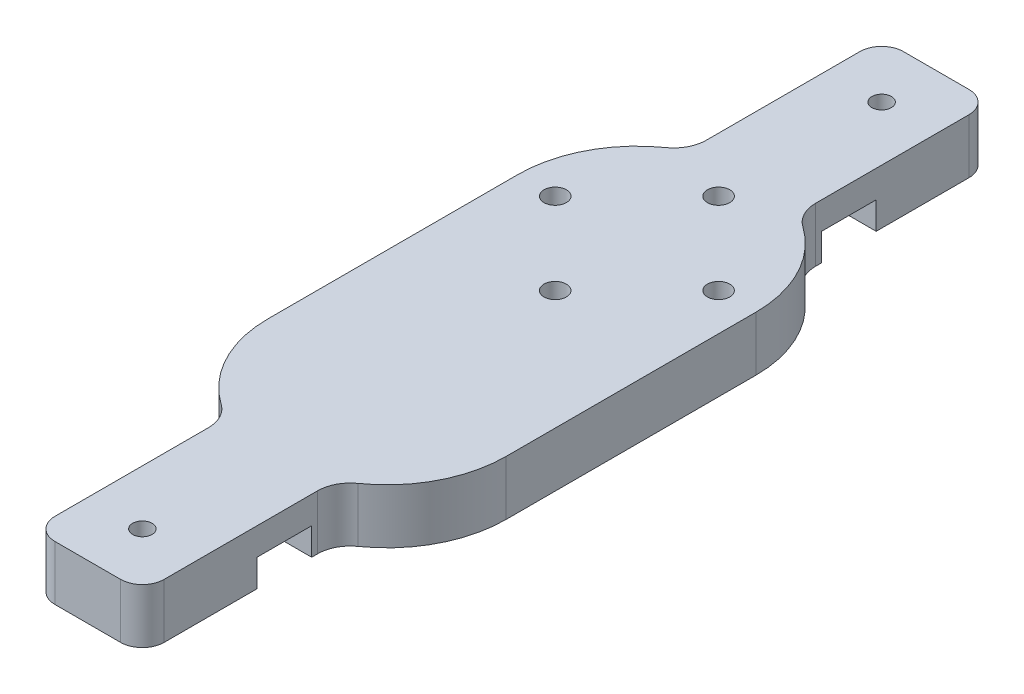
ISO-10303-21;
HEADER;
FILE_DESCRIPTION(('STEP AP214'),'2;1');
FILE_NAME('part.step','',(''),(''),'','','');
FILE_SCHEMA(('AUTOMOTIVE_DESIGN { 1 0 10303 214 1 1 1 1 }'));
ENDSEC;
DATA;
#1=APPLICATION_CONTEXT('core data for automotive mechanical design processes');
#2=APPLICATION_PROTOCOL_DEFINITION('international standard','automotive_design',2000,#1);
#3=PRODUCT_CONTEXT('',#1,'mechanical');
#4=PRODUCT('Part','Part','',(#3));
#5=PRODUCT_RELATED_PRODUCT_CATEGORY('part','',(#4));
#6=PRODUCT_DEFINITION_FORMATION('','',#4);
#7=PRODUCT_DEFINITION_CONTEXT('part definition',#1,'design');
#8=PRODUCT_DEFINITION('design','',#6,#7);
#9=PRODUCT_DEFINITION_SHAPE('','',#8);
#10=(LENGTH_UNIT() NAMED_UNIT(*) SI_UNIT(.MILLI.,.METRE.));
#11=(NAMED_UNIT(*) PLANE_ANGLE_UNIT() SI_UNIT($,.RADIAN.));
#12=(NAMED_UNIT(*) SI_UNIT($,.STERADIAN.) SOLID_ANGLE_UNIT());
#13=UNCERTAINTY_MEASURE_WITH_UNIT(LENGTH_MEASURE(1.E-05),#10,'distance_accuracy_value','');
#14=(GEOMETRIC_REPRESENTATION_CONTEXT(3) GLOBAL_UNCERTAINTY_ASSIGNED_CONTEXT((#13)) GLOBAL_UNIT_ASSIGNED_CONTEXT((#10,
#11,#12)) REPRESENTATION_CONTEXT('',''));
#15=CARTESIAN_POINT('',(0.,0.,0.));
#16=DIRECTION('',(0.,0.,1.));
#17=DIRECTION('',(1.,0.,0.));
#18=AXIS2_PLACEMENT_3D('',#15,#16,#17);
#19=CARTESIAN_POINT('',(6.35,6.35,36.062769886));
#20=DIRECTION('',(-1.,0.,0.));
#21=DIRECTION('',(0.,0.,1.));
#22=AXIS2_PLACEMENT_3D('',#19,#20,#21);
#23=PLANE('',#22);
#24=DIRECTION('',(0.,0.,-1.));
#25=VECTOR('',#24,1.);
#26=CARTESIAN_POINT('',(6.35,0.,36.062769886));
#27=LINE('',#26,#25);
#28=CARTESIAN_POINT('',(6.35,0.,38.878651732));
#29=VERTEX_POINT('',#28);
#30=CARTESIAN_POINT('',(6.35,0.,38.19895848807));
#31=VERTEX_POINT('',#30);
#32=EDGE_CURVE('E330',#29,#31,#27,.T.);
#33=ORIENTED_EDGE('',*,*,#32,.T.);
#34=DIRECTION('',(0.,1.,0.));
#35=VECTOR('',#34,1.);
#36=CARTESIAN_POINT('',(6.35,6.35,38.19895848807));
#37=LINE('',#36,#35);
#38=CARTESIAN_POINT('',(6.35,6.35,38.19895848807));
#39=VERTEX_POINT('',#38);
#40=EDGE_CURVE('E413',#31,#39,#37,.T.);
#41=ORIENTED_EDGE('',*,*,#40,.T.);
#42=DIRECTION('',(0.,0.,-1.));
#43=VECTOR('',#42,1.);
#44=CARTESIAN_POINT('',(6.35,6.35,36.062769886));
#45=LINE('',#44,#43);
#46=CARTESIAN_POINT('',(6.35,6.35,56.023651732));
#47=VERTEX_POINT('',#46);
#48=EDGE_CURVE('E293',#47,#39,#45,.T.);
#49=ORIENTED_EDGE('',*,*,#48,.F.);
#50=DIRECTION('',(0.,-1.,0.));
#51=VECTOR('',#50,1.);
#52=CARTESIAN_POINT('',(6.35,6.35,56.023651732));
#53=LINE('',#52,#51);
#54=CARTESIAN_POINT('',(6.35,0.,56.023651732));
#55=VERTEX_POINT('',#54);
#56=EDGE_CURVE('E397',#47,#55,#53,.T.);
#57=ORIENTED_EDGE('',*,*,#56,.T.);
#58=CARTESIAN_POINT('',(6.35,0.,45.228651732));
#59=VERTEX_POINT('',#58);
#60=EDGE_CURVE('E331',#55,#59,#27,.T.);
#61=ORIENTED_EDGE('',*,*,#60,.T.);
#62=DIRECTION('',(0.,-1.,0.));
#63=VECTOR('',#62,1.);
#64=CARTESIAN_POINT('',(6.35,3.175,45.228651732));
#65=LINE('',#64,#63);
#66=CARTESIAN_POINT('',(6.35,3.175,45.228651732));
#67=VERTEX_POINT('',#66);
#68=EDGE_CURVE('E254',#67,#59,#65,.T.);
#69=ORIENTED_EDGE('',*,*,#68,.F.);
#70=DIRECTION('',(0.,0.,1.));
#71=VECTOR('',#70,1.);
#72=CARTESIAN_POINT('',(6.35,3.175,0.));
#73=LINE('',#72,#71);
#74=CARTESIAN_POINT('',(6.35,3.175,38.878651732));
#75=VERTEX_POINT('',#74);
#76=EDGE_CURVE('E272',#75,#67,#73,.T.);
#77=ORIENTED_EDGE('',*,*,#76,.F.);
#78=DIRECTION('',(0.,-1.,0.));
#79=VECTOR('',#78,1.);
#80=CARTESIAN_POINT('',(6.35,3.175,38.878651732));
#81=LINE('',#80,#79);
#82=EDGE_CURVE('E282',#75,#29,#81,.T.);
#83=ORIENTED_EDGE('',*,*,#82,.T.);
#84=EDGE_LOOP('',(#33,#41,#49,#57,#61,#69,#77,#83));
#85=FACE_BOUND('',#84,.T.);
#86=ADVANCED_FACE('F36',(#85),#23,.F.);
#87=CARTESIAN_POINT('',(6.35,6.35,-17.6002686339026));
#88=DIRECTION('',(-1.,0.,0.));
#89=DIRECTION('',(0.,0.,1.));
#90=AXIS2_PLACEMENT_3D('',#87,#88,#89);
#91=PLANE('',#90);
#92=DIRECTION('',(0.,0.,-1.));
#93=VECTOR('',#92,1.);
#94=CARTESIAN_POINT('',(6.35,6.35,-17.6002686339026));
#95=LINE('',#94,#93);
#96=CARTESIAN_POINT('',(6.35,6.35,-19.7364572359725));
#97=VERTEX_POINT('',#96);
#98=CARTESIAN_POINT('',(6.35,6.35,-37.56114916));
#99=VERTEX_POINT('',#98);
#100=EDGE_CURVE('E303',#97,#99,#95,.T.);
#101=ORIENTED_EDGE('',*,*,#100,.F.);
#102=DIRECTION('',(0.,1.,0.));
#103=VECTOR('',#102,1.);
#104=CARTESIAN_POINT('',(6.35,0.,-19.7364572359725));
#105=LINE('',#104,#103);
#106=CARTESIAN_POINT('',(6.35,0.,-19.7364572359725));
#107=VERTEX_POINT('',#106);
#108=EDGE_CURVE('E415',#97,#107,#105,.F.);
#109=ORIENTED_EDGE('',*,*,#108,.T.);
#110=DIRECTION('',(0.,0.,-1.));
#111=VECTOR('',#110,1.);
#112=CARTESIAN_POINT('',(6.35,0.,-17.6002686339026));
#113=LINE('',#112,#111);
#114=CARTESIAN_POINT('',(6.35,0.,-20.41614916));
#115=VERTEX_POINT('',#114);
#116=EDGE_CURVE('E341',#107,#115,#113,.T.);
#117=ORIENTED_EDGE('',*,*,#116,.T.);
#118=DIRECTION('',(0.,-1.,0.));
#119=VECTOR('',#118,1.);
#120=CARTESIAN_POINT('',(6.35,3.175,-20.41614916));
#121=LINE('',#120,#119);
#122=CARTESIAN_POINT('',(6.35,3.175,-20.41614916));
#123=VERTEX_POINT('',#122);
#124=EDGE_CURVE('E256',#123,#115,#121,.T.);
#125=ORIENTED_EDGE('',*,*,#124,.F.);
#126=DIRECTION('',(0.,0.,1.));
#127=VECTOR('',#126,1.);
#128=CARTESIAN_POINT('',(6.35,3.175,0.));
#129=LINE('',#128,#127);
#130=CARTESIAN_POINT('',(6.35,3.175,-26.76614916));
#131=VERTEX_POINT('',#130);
#132=EDGE_CURVE('E233',#131,#123,#129,.T.);
#133=ORIENTED_EDGE('',*,*,#132,.F.);
#134=DIRECTION('',(0.,-1.,0.));
#135=VECTOR('',#134,1.);
#136=CARTESIAN_POINT('',(6.35,3.175,-26.76614916));
#137=LINE('',#136,#135);
#138=CARTESIAN_POINT('',(6.35,0.,-26.76614916));
#139=VERTEX_POINT('',#138);
#140=EDGE_CURVE('E259',#131,#139,#137,.T.);
#141=ORIENTED_EDGE('',*,*,#140,.T.);
#142=CARTESIAN_POINT('',(6.35,0.,-37.56114916));
#143=VERTEX_POINT('',#142);
#144=EDGE_CURVE('E340',#139,#143,#113,.T.);
#145=ORIENTED_EDGE('',*,*,#144,.T.);
#146=DIRECTION('',(0.,-1.,0.));
#147=VECTOR('',#146,1.);
#148=CARTESIAN_POINT('',(6.35,6.35,-37.56114916));
#149=LINE('',#148,#147);
#150=EDGE_CURVE('E388',#99,#143,#149,.T.);
#151=ORIENTED_EDGE('',*,*,#150,.F.);
#152=EDGE_LOOP('',(#101,#109,#117,#125,#133,#141,#145,#151));
#153=FACE_BOUND('',#152,.T.);
#154=ADVANCED_FACE('F506',(#153),#91,.F.);
#155=CARTESIAN_POINT('',(-6.35,6.35,-17.6002686339026));
#156=DIRECTION('',(1.,0.,0.));
#157=DIRECTION('',(0.,0.,-1.));
#158=AXIS2_PLACEMENT_3D('',#155,#156,#157);
#159=PLANE('',#158);
#160=DIRECTION('',(0.,0.,1.));
#161=VECTOR('',#160,1.);
#162=CARTESIAN_POINT('',(-6.35,0.,-17.6002686339026));
#163=LINE('',#162,#161);
#164=CARTESIAN_POINT('',(-6.35,0.,-20.41614916));
#165=VERTEX_POINT('',#164);
#166=CARTESIAN_POINT('',(-6.35,0.,-19.7364572359725));
#167=VERTEX_POINT('',#166);
#168=EDGE_CURVE('E349',#165,#167,#163,.T.);
#169=ORIENTED_EDGE('',*,*,#168,.T.);
#170=DIRECTION('',(0.,1.,0.));
#171=VECTOR('',#170,1.);
#172=CARTESIAN_POINT('',(-6.35,6.35,-19.7364572359725));
#173=LINE('',#172,#171);
#174=CARTESIAN_POINT('',(-6.35,6.35,-19.7364572359725));
#175=VERTEX_POINT('',#174);
#176=EDGE_CURVE('E408',#167,#175,#173,.T.);
#177=ORIENTED_EDGE('',*,*,#176,.T.);
#178=DIRECTION('',(0.,0.,1.));
#179=VECTOR('',#178,1.);
#180=CARTESIAN_POINT('',(-6.35,6.35,-17.6002686339026));
#181=LINE('',#180,#179);
#182=CARTESIAN_POINT('',(-6.35,6.35,-37.56114916));
#183=VERTEX_POINT('',#182);
#184=EDGE_CURVE('E311',#183,#175,#181,.T.);
#185=ORIENTED_EDGE('',*,*,#184,.F.);
#186=DIRECTION('',(0.,-1.,0.));
#187=VECTOR('',#186,1.);
#188=CARTESIAN_POINT('',(-6.35,6.35,-37.56114916));
#189=LINE('',#188,#187);
#190=CARTESIAN_POINT('',(-6.35,0.,-37.56114916));
#191=VERTEX_POINT('',#190);
#192=EDGE_CURVE('E379',#183,#191,#189,.T.);
#193=ORIENTED_EDGE('',*,*,#192,.T.);
#194=CARTESIAN_POINT('',(-6.35,0.,-26.76614916));
#195=VERTEX_POINT('',#194);
#196=EDGE_CURVE('E350',#191,#195,#163,.T.);
#197=ORIENTED_EDGE('',*,*,#196,.T.);
#198=DIRECTION('',(0.,-1.,0.));
#199=VECTOR('',#198,1.);
#200=CARTESIAN_POINT('',(-6.35,3.175,-26.76614916));
#201=LINE('',#200,#199);
#202=CARTESIAN_POINT('',(-6.35,3.175,-26.76614916));
#203=VERTEX_POINT('',#202);
#204=EDGE_CURVE('E232',#203,#195,#201,.T.);
#205=ORIENTED_EDGE('',*,*,#204,.F.);
#206=DIRECTION('',(0.,0.,-1.));
#207=VECTOR('',#206,1.);
#208=CARTESIAN_POINT('',(-6.35,3.175,0.));
#209=LINE('',#208,#207);
#210=CARTESIAN_POINT('',(-6.35,3.175,-20.41614916));
#211=VERTEX_POINT('',#210);
#212=EDGE_CURVE('E239',#211,#203,#209,.T.);
#213=ORIENTED_EDGE('',*,*,#212,.F.);
#214=DIRECTION('',(0.,-1.,0.));
#215=VECTOR('',#214,1.);
#216=CARTESIAN_POINT('',(-6.35,3.175,-20.41614916));
#217=LINE('',#216,#215);
#218=EDGE_CURVE('E220',#211,#165,#217,.T.);
#219=ORIENTED_EDGE('',*,*,#218,.T.);
#220=EDGE_LOOP('',(#169,#177,#185,#193,#197,#205,#213,#219));
#221=FACE_BOUND('',#220,.T.);
#222=ADVANCED_FACE('F245',(#221),#159,.F.);
#223=CARTESIAN_POINT('',(-6.35,6.35,36.062769886));
#224=DIRECTION('',(1.,0.,0.));
#225=DIRECTION('',(0.,0.,-1.));
#226=AXIS2_PLACEMENT_3D('',#223,#224,#225);
#227=PLANE('',#226);
#228=DIRECTION('',(0.,0.,1.));
#229=VECTOR('',#228,1.);
#230=CARTESIAN_POINT('',(-6.35,6.35,36.062769886));
#231=LINE('',#230,#229);
#232=CARTESIAN_POINT('',(-6.35,6.35,38.19895848807));
#233=VERTEX_POINT('',#232);
#234=CARTESIAN_POINT('',(-6.35,6.35,56.023651732));
#235=VERTEX_POINT('',#234);
#236=EDGE_CURVE('E321',#233,#235,#231,.T.);
#237=ORIENTED_EDGE('',*,*,#236,.F.);
#238=DIRECTION('',(0.,1.,0.));
#239=VECTOR('',#238,1.);
#240=CARTESIAN_POINT('',(-6.35,0.,38.19895848807));
#241=LINE('',#240,#239);
#242=CARTESIAN_POINT('',(-6.35,0.,38.19895848807));
#243=VERTEX_POINT('',#242);
#244=EDGE_CURVE('E400',#233,#243,#241,.F.);
#245=ORIENTED_EDGE('',*,*,#244,.T.);
#246=DIRECTION('',(0.,0.,1.));
#247=VECTOR('',#246,1.);
#248=CARTESIAN_POINT('',(-6.35,0.,36.062769886));
#249=LINE('',#248,#247);
#250=CARTESIAN_POINT('',(-6.35,0.,38.878651732));
#251=VERTEX_POINT('',#250);
#252=EDGE_CURVE('E360',#243,#251,#249,.T.);
#253=ORIENTED_EDGE('',*,*,#252,.T.);
#254=DIRECTION('',(0.,-1.,0.));
#255=VECTOR('',#254,1.);
#256=CARTESIAN_POINT('',(-6.35,3.175,38.878651732));
#257=LINE('',#256,#255);
#258=CARTESIAN_POINT('',(-6.35,3.175,38.878651732));
#259=VERTEX_POINT('',#258);
#260=EDGE_CURVE('E285',#259,#251,#257,.T.);
#261=ORIENTED_EDGE('',*,*,#260,.F.);
#262=DIRECTION('',(0.,0.,-1.));
#263=VECTOR('',#262,1.);
#264=CARTESIAN_POINT('',(-6.35,3.175,0.));
#265=LINE('',#264,#263);
#266=CARTESIAN_POINT('',(-6.35,3.175,45.228651732));
#267=VERTEX_POINT('',#266);
#268=EDGE_CURVE('E265',#267,#259,#265,.T.);
#269=ORIENTED_EDGE('',*,*,#268,.F.);
#270=DIRECTION('',(0.,-1.,0.));
#271=VECTOR('',#270,1.);
#272=CARTESIAN_POINT('',(-6.35,3.175,45.228651732));
#273=LINE('',#272,#271);
#274=CARTESIAN_POINT('',(-6.35,0.,45.228651732));
#275=VERTEX_POINT('',#274);
#276=EDGE_CURVE('E275',#267,#275,#273,.T.);
#277=ORIENTED_EDGE('',*,*,#276,.T.);
#278=CARTESIAN_POINT('',(-6.35,0.,56.023651732));
#279=VERTEX_POINT('',#278);
#280=EDGE_CURVE('E359',#275,#279,#249,.T.);
#281=ORIENTED_EDGE('',*,*,#280,.T.);
#282=DIRECTION('',(0.,-1.,0.));
#283=VECTOR('',#282,1.);
#284=CARTESIAN_POINT('',(-6.35,6.35,56.023651732));
#285=LINE('',#284,#283);
#286=EDGE_CURVE('E370',#235,#279,#285,.T.);
#287=ORIENTED_EDGE('',*,*,#286,.F.);
#288=EDGE_LOOP('',(#237,#245,#253,#261,#269,#277,#281,#287));
#289=FACE_BOUND('',#288,.T.);
#290=ADVANCED_FACE('F460',(#289),#227,.F.);
#291=CARTESIAN_POINT('',(3.81,0.,56.023651732));
#292=DIRECTION('',(0.,-1.,0.));
#293=DIRECTION('',(0.,0.,-1.));
#294=AXIS2_PLACEMENT_3D('',#291,#292,#293);
#295=PLANE('',#294);
#296=CARTESIAN_POINT('',(-9.50000005,0.,-5.29173492085776));
#297=DIRECTION('',(0.,-1.,0.));
#298=DIRECTION('',(0.,0.,-1.));
#299=AXIS2_PLACEMENT_3D('',#296,#297,#298);
#300=CIRCLE('',#299,1.3);
#301=CARTESIAN_POINT('',(-9.50000005,0.,-6.59173492085776));
#302=VERTEX_POINT('',#301);
#303=EDGE_CURVE('E881',#302,#302,#300,.T.);
#304=ORIENTED_EDGE('',*,*,#303,.F.);
#305=EDGE_LOOP('',(#304));
#306=FACE_BOUND('',#305,.T.);
#307=CARTESIAN_POINT('',(0.,0.,-14.7917349708578));
#308=DIRECTION('',(0.,-1.,0.));
#309=DIRECTION('',(0.,0.,-1.));
#310=AXIS2_PLACEMENT_3D('',#307,#308,#309);
#311=CIRCLE('',#310,1.3);
#312=CARTESIAN_POINT('',(0.,0.,-16.0917349708578));
#313=VERTEX_POINT('',#312);
#314=EDGE_CURVE('E877',#313,#313,#311,.T.);
#315=ORIENTED_EDGE('',*,*,#314,.F.);
#316=EDGE_LOOP('',(#315));
#317=FACE_BOUND('',#316,.T.);
#318=CARTESIAN_POINT('',(9.50000005,0.,-5.29173492085776));
#319=DIRECTION('',(0.,-1.,0.));
#320=DIRECTION('',(0.,0.,-1.));
#321=AXIS2_PLACEMENT_3D('',#318,#319,#320);
#322=CIRCLE('',#321,1.3);
#323=CARTESIAN_POINT('',(9.50000005,0.,-6.59173492085776));
#324=VERTEX_POINT('',#323);
#325=EDGE_CURVE('E873',#324,#324,#322,.T.);
#326=ORIENTED_EDGE('',*,*,#325,.F.);
#327=EDGE_LOOP('',(#326));
#328=FACE_BOUND('',#327,.T.);
#329=CARTESIAN_POINT('',(0.,0.,4.20826512914224));
#330=DIRECTION('',(0.,-1.,0.));
#331=DIRECTION('',(0.,0.,-1.));
#332=AXIS2_PLACEMENT_3D('',#329,#330,#331);
#333=CIRCLE('',#332,1.3);
#334=CARTESIAN_POINT('',(0.,0.,2.90826512914224));
#335=VERTEX_POINT('',#334);
#336=EDGE_CURVE('E869',#335,#335,#333,.T.);
#337=ORIENTED_EDGE('',*,*,#336,.F.);
#338=EDGE_LOOP('',(#337));
#339=FACE_BOUND('',#338,.T.);
#340=ORIENTED_EDGE('',*,*,#168,.F.);
#341=DIRECTION('',(1.,0.,0.));
#342=VECTOR('',#341,1.);
#343=CARTESIAN_POINT('',(0.,0.,-20.41614916));
#344=LINE('',#343,#342);
#345=EDGE_CURVE('E227',#165,#115,#344,.T.);
#346=ORIENTED_EDGE('',*,*,#345,.T.);
#347=ORIENTED_EDGE('',*,*,#116,.F.);
#348=CARTESIAN_POINT('',(10.16,0.,-19.7364572359725));
#349=DIRECTION('',(0.,-1.,0.));
#350=DIRECTION('',(0.,0.,-1.));
#351=AXIS2_PLACEMENT_3D('',#348,#349,#350);
#352=CIRCLE('',#351,3.81);
#353=CARTESIAN_POINT('',(7.96806342986024,0.,-16.6201270107743));
#354=VERTEX_POINT('',#353);
#355=EDGE_CURVE('E44',#107,#354,#352,.F.);
#356=ORIENTED_EDGE('',*,*,#355,.T.);
#357=CARTESIAN_POINT('',(0.,0.,-5.29173492085776));
#358=DIRECTION('',(0.,1.,0.));
#359=DIRECTION('',(0.,0.,1.));
#360=AXIS2_PLACEMENT_3D('',#357,#358,#359);
#361=CIRCLE('',#360,13.8500000781646);
#362=CARTESIAN_POINT('',(13.8500000781646,0.,-5.29173492085776));
#363=VERTEX_POINT('',#362);
#364=EDGE_CURVE('E338',#363,#354,#361,.T.);
#365=ORIENTED_EDGE('',*,*,#364,.F.);
#366=DIRECTION('',(0.,0.,-1.));
#367=VECTOR('',#366,1.);
#368=CARTESIAN_POINT('',(13.8500000781646,0.,23.7542361729552));
#369=LINE('',#368,#367);
#370=CARTESIAN_POINT('',(13.8500000781646,0.,23.7542361729552));
#371=VERTEX_POINT('',#370);
#372=EDGE_CURVE('E336',#371,#363,#369,.T.);
#373=ORIENTED_EDGE('',*,*,#372,.F.);
#374=CARTESIAN_POINT('',(0.,0.,23.7542361729552));
#375=DIRECTION('',(0.,1.,0.));
#376=DIRECTION('',(0.,0.,1.));
#377=AXIS2_PLACEMENT_3D('',#374,#375,#376);
#378=CIRCLE('',#377,13.8500000781646);
#379=CARTESIAN_POINT('',(7.96806342986024,0.,35.0826282628718));
#380=VERTEX_POINT('',#379);
#381=EDGE_CURVE('E334',#380,#371,#378,.T.);
#382=ORIENTED_EDGE('',*,*,#381,.F.);
#383=CARTESIAN_POINT('',(10.16,0.,38.19895848807));
#384=DIRECTION('',(0.,-1.,0.));
#385=DIRECTION('',(0.,0.,-1.));
#386=AXIS2_PLACEMENT_3D('',#383,#384,#385);
#387=CIRCLE('',#386,3.81);
#388=EDGE_CURVE('E427',#380,#31,#387,.F.);
#389=ORIENTED_EDGE('',*,*,#388,.T.);
#390=ORIENTED_EDGE('',*,*,#32,.F.);
#391=DIRECTION('',(1.,0.,0.));
#392=VECTOR('',#391,1.);
#393=CARTESIAN_POINT('',(0.,0.,38.878651732));
#394=LINE('',#393,#392);
#395=EDGE_CURVE('E266',#251,#29,#394,.T.);
#396=ORIENTED_EDGE('',*,*,#395,.F.);
#397=ORIENTED_EDGE('',*,*,#252,.F.);
#398=CARTESIAN_POINT('',(-10.16,0.,38.19895848807));
#399=DIRECTION('',(0.,-1.,0.));
#400=DIRECTION('',(0.,0.,-1.));
#401=AXIS2_PLACEMENT_3D('',#398,#399,#400);
#402=CIRCLE('',#401,3.81);
#403=CARTESIAN_POINT('',(-7.96806342986025,0.,35.0826282628718));
#404=VERTEX_POINT('',#403);
#405=EDGE_CURVE('E419',#243,#404,#402,.F.);
#406=ORIENTED_EDGE('',*,*,#405,.T.);
#407=CARTESIAN_POINT('',(0.,0.,23.7542361729552));
#408=DIRECTION('',(0.,1.,0.));
#409=DIRECTION('',(0.,0.,1.));
#410=AXIS2_PLACEMENT_3D('',#407,#408,#409);
#411=CIRCLE('',#410,13.8500000781646);
#412=CARTESIAN_POINT('',(-13.8500000781646,0.,23.7542361729552));
#413=VERTEX_POINT('',#412);
#414=EDGE_CURVE('E356',#413,#404,#411,.T.);
#415=ORIENTED_EDGE('',*,*,#414,.F.);
#416=DIRECTION('',(0.,0.,1.));
#417=VECTOR('',#416,1.);
#418=CARTESIAN_POINT('',(-13.8500000781646,0.,-5.29173492085776));
#419=LINE('',#418,#417);
#420=CARTESIAN_POINT('',(-13.8500000781646,0.,-5.29173492085776));
#421=VERTEX_POINT('',#420);
#422=EDGE_CURVE('E354',#421,#413,#419,.T.);
#423=ORIENTED_EDGE('',*,*,#422,.F.);
#424=CARTESIAN_POINT('',(0.,0.,-5.29173492085776));
#425=DIRECTION('',(0.,1.,0.));
#426=DIRECTION('',(0.,0.,1.));
#427=AXIS2_PLACEMENT_3D('',#424,#425,#426);
#428=CIRCLE('',#427,13.8500000781646);
#429=CARTESIAN_POINT('',(-7.96806342986024,0.,-16.6201270107743));
#430=VERTEX_POINT('',#429);
#431=EDGE_CURVE('E352',#430,#421,#428,.T.);
#432=ORIENTED_EDGE('',*,*,#431,.F.);
#433=CARTESIAN_POINT('',(-10.16,0.,-19.7364572359725));
#434=DIRECTION('',(0.,-1.,0.));
#435=DIRECTION('',(0.,0.,-1.));
#436=AXIS2_PLACEMENT_3D('',#433,#434,#435);
#437=CIRCLE('',#436,3.81);
#438=EDGE_CURVE('E423',#430,#167,#437,.F.);
#439=ORIENTED_EDGE('',*,*,#438,.T.);
#440=EDGE_LOOP('',(#340,#346,#347,#356,#365,#373,#382,#389,#390,#396,#397,#406,#415,#423,#432,#439));
#441=FACE_BOUND('',#440,.T.);
#442=ADVANCED_FACE('F445',(#306,#317,#328,#339,#441),#295,.T.);
#443=CARTESIAN_POINT('',(0.,0.,52.213651732));
#444=DIRECTION('',(0.,-1.,0.));
#445=DIRECTION('',(0.,0.,-1.));
#446=AXIS2_PLACEMENT_3D('',#443,#444,#445);
#447=CIRCLE('',#446,1.1303);
#448=CARTESIAN_POINT('',(0.,0.,51.083351732));
#449=VERTEX_POINT('',#448);
#450=EDGE_CURVE('E865',#449,#449,#447,.T.);
#451=ORIENTED_EDGE('',*,*,#450,.F.);
#452=EDGE_LOOP('',(#451));
#453=FACE_BOUND('',#452,.T.);
#454=ORIENTED_EDGE('',*,*,#280,.F.);
#455=DIRECTION('',(1.,0.,0.));
#456=VECTOR('',#455,1.);
#457=CARTESIAN_POINT('',(0.,0.,45.228651732));
#458=LINE('',#457,#456);
#459=EDGE_CURVE('E276',#275,#59,#458,.T.);
#460=ORIENTED_EDGE('',*,*,#459,.T.);
#461=ORIENTED_EDGE('',*,*,#60,.F.);
#462=CARTESIAN_POINT('',(3.81,0.,56.023651732));
#463=DIRECTION('',(0.,1.,0.));
#464=DIRECTION('',(0.,0.,-1.));
#465=AXIS2_PLACEMENT_3D('',#462,#463,#464);
#466=CIRCLE('',#465,2.54);
#467=CARTESIAN_POINT('',(3.80999999999998,0.,58.563651732));
#468=VERTEX_POINT('',#467);
#469=EDGE_CURVE('E258',#468,#55,#466,.T.);
#470=ORIENTED_EDGE('',*,*,#469,.F.);
#471=DIRECTION('',(1.,0.,0.));
#472=VECTOR('',#471,1.);
#473=CARTESIAN_POINT('',(3.80999999999998,0.,58.563651732));
#474=LINE('',#473,#472);
#475=CARTESIAN_POINT('',(-3.81,0.,58.563651732));
#476=VERTEX_POINT('',#475);
#477=EDGE_CURVE('E294',#476,#468,#474,.T.);
#478=ORIENTED_EDGE('',*,*,#477,.F.);
#479=CARTESIAN_POINT('',(-3.81,0.,56.023651732));
#480=DIRECTION('',(0.,1.,0.));
#481=DIRECTION('',(0.,0.,1.));
#482=AXIS2_PLACEMENT_3D('',#479,#480,#481);
#483=CIRCLE('',#482,2.54);
#484=EDGE_CURVE('E362',#279,#476,#483,.T.);
#485=ORIENTED_EDGE('',*,*,#484,.F.);
#486=EDGE_LOOP('',(#454,#460,#461,#470,#478,#485));
#487=FACE_BOUND('',#486,.T.);
#488=ADVANCED_FACE('F491',(#453,#487),#295,.T.);
#489=CARTESIAN_POINT('',(3.81,6.35,56.023651732));
#490=DIRECTION('',(0.,-1.,0.));
#491=DIRECTION('',(0.,0.,-1.));
#492=AXIS2_PLACEMENT_3D('',#489,#490,#491);
#493=CYLINDRICAL_SURFACE('',#492,2.54);
#494=ORIENTED_EDGE('',*,*,#469,.T.);
#495=ORIENTED_EDGE('',*,*,#56,.F.);
#496=CARTESIAN_POINT('',(3.81,6.35,56.023651732));
#497=DIRECTION('',(0.,1.,0.));
#498=DIRECTION('',(0.,0.,-1.));
#499=AXIS2_PLACEMENT_3D('',#496,#497,#498);
#500=CIRCLE('',#499,2.54);
#501=CARTESIAN_POINT('',(3.80999999999998,6.35,58.563651732));
#502=VERTEX_POINT('',#501);
#503=EDGE_CURVE('E290',#502,#47,#500,.T.);
#504=ORIENTED_EDGE('',*,*,#503,.F.);
#505=DIRECTION('',(0.,-1.,0.));
#506=VECTOR('',#505,1.);
#507=CARTESIAN_POINT('',(3.80999999999998,6.35,58.563651732));
#508=LINE('',#507,#506);
#509=EDGE_CURVE('E327',#502,#468,#508,.T.);
#510=ORIENTED_EDGE('',*,*,#509,.T.);
#511=EDGE_LOOP('',(#494,#495,#504,#510));
#512=FACE_BOUND('',#511,.T.);
#513=ADVANCED_FACE('F489',(#512),#493,.T.);
#514=CARTESIAN_POINT('',(0.,6.35,23.7542361729552));
#515=DIRECTION('',(0.,-1.,0.));
#516=DIRECTION('',(0.,0.,-1.));
#517=AXIS2_PLACEMENT_3D('',#514,#515,#516);
#518=CYLINDRICAL_SURFACE('',#517,13.8500000781646);
#519=CARTESIAN_POINT('',(0.,6.35,23.7542361729552));
#520=DIRECTION('',(0.,1.,0.));
#521=DIRECTION('',(0.,0.,1.));
#522=AXIS2_PLACEMENT_3D('',#519,#520,#521);
#523=CIRCLE('',#522,13.8500000781646);
#524=CARTESIAN_POINT('',(7.96806342986024,6.35,35.0826282628718));
#525=VERTEX_POINT('',#524);
#526=CARTESIAN_POINT('',(13.8500000781646,6.35,23.7542361729552));
#527=VERTEX_POINT('',#526);
#528=EDGE_CURVE('E297',#525,#527,#523,.T.);
#529=ORIENTED_EDGE('',*,*,#528,.F.);
#530=DIRECTION('',(0.,-1.,0.));
#531=VECTOR('',#530,1.);
#532=CARTESIAN_POINT('',(7.96806342986024,6.35,35.0826282628718));
#533=LINE('',#532,#531);
#534=EDGE_CURVE('E410',#525,#380,#533,.T.);
#535=ORIENTED_EDGE('',*,*,#534,.T.);
#536=ORIENTED_EDGE('',*,*,#381,.T.);
#537=DIRECTION('',(0.,-1.,0.));
#538=VECTOR('',#537,1.);
#539=CARTESIAN_POINT('',(13.8500000781646,6.35,23.7542361729552));
#540=LINE('',#539,#538);
#541=EDGE_CURVE('E394',#527,#371,#540,.T.);
#542=ORIENTED_EDGE('',*,*,#541,.F.);
#543=EDGE_LOOP('',(#529,#535,#536,#542));
#544=FACE_BOUND('',#543,.T.);
#545=ADVANCED_FACE('F439',(#544),#518,.T.);
#546=CARTESIAN_POINT('',(13.8500000781646,6.35,23.7542361729552));
#547=DIRECTION('',(-1.,0.,0.));
#548=DIRECTION('',(0.,0.,1.));
#549=AXIS2_PLACEMENT_3D('',#546,#547,#548);
#550=PLANE('',#549);
#551=ORIENTED_EDGE('',*,*,#372,.T.);
#552=DIRECTION('',(0.,-1.,0.));
#553=VECTOR('',#552,1.);
#554=CARTESIAN_POINT('',(13.8500000781646,6.35,-5.29173492085776));
#555=LINE('',#554,#553);
#556=CARTESIAN_POINT('',(13.8500000781646,6.35,-5.29173492085776));
#557=VERTEX_POINT('',#556);
#558=EDGE_CURVE('E391',#557,#363,#555,.T.);
#559=ORIENTED_EDGE('',*,*,#558,.F.);
#560=DIRECTION('',(0.,0.,-1.));
#561=VECTOR('',#560,1.);
#562=CARTESIAN_POINT('',(13.8500000781646,6.35,23.7542361729552));
#563=LINE('',#562,#561);
#564=EDGE_CURVE('E299',#527,#557,#563,.T.);
#565=ORIENTED_EDGE('',*,*,#564,.F.);
#566=ORIENTED_EDGE('',*,*,#541,.T.);
#567=EDGE_LOOP('',(#551,#559,#565,#566));
#568=FACE_BOUND('',#567,.T.);
#569=ADVANCED_FACE('F584',(#568),#550,.F.);
#570=CARTESIAN_POINT('',(0.,6.35,-5.29173492085776));
#571=DIRECTION('',(0.,-1.,0.));
#572=DIRECTION('',(0.,0.,-1.));
#573=AXIS2_PLACEMENT_3D('',#570,#571,#572);
#574=CYLINDRICAL_SURFACE('',#573,13.8500000781646);
#575=ORIENTED_EDGE('',*,*,#364,.T.);
#576=DIRECTION('',(0.,-1.,0.));
#577=VECTOR('',#576,1.);
#578=CARTESIAN_POINT('',(7.96806342986024,6.35,-16.6201270107743));
#579=LINE('',#578,#577);
#580=CARTESIAN_POINT('',(7.96806342986024,6.35,-16.6201270107743));
#581=VERTEX_POINT('',#580);
#582=EDGE_CURVE('E51',#354,#581,#579,.F.);
#583=ORIENTED_EDGE('',*,*,#582,.T.);
#584=CARTESIAN_POINT('',(0.,6.35,-5.29173492085776));
#585=DIRECTION('',(0.,1.,0.));
#586=DIRECTION('',(0.,0.,1.));
#587=AXIS2_PLACEMENT_3D('',#584,#585,#586);
#588=CIRCLE('',#587,13.8500000781646);
#589=EDGE_CURVE('E301',#557,#581,#588,.T.);
#590=ORIENTED_EDGE('',*,*,#589,.F.);
#591=ORIENTED_EDGE('',*,*,#558,.T.);
#592=EDGE_LOOP('',(#575,#583,#590,#591));
#593=FACE_BOUND('',#592,.T.);
#594=ADVANCED_FACE('F581',(#593),#574,.T.);
#595=CARTESIAN_POINT('',(3.81,6.35,-37.56114916));
#596=DIRECTION('',(0.,-1.,0.));
#597=DIRECTION('',(0.,0.,-1.));
#598=AXIS2_PLACEMENT_3D('',#595,#596,#597);
#599=CYLINDRICAL_SURFACE('',#598,2.54);
#600=CARTESIAN_POINT('',(3.81,0.,-37.56114916));
#601=DIRECTION('',(0.,1.,0.));
#602=DIRECTION('',(0.,0.,1.));
#603=AXIS2_PLACEMENT_3D('',#600,#601,#602);
#604=CIRCLE('',#603,2.54);
#605=CARTESIAN_POINT('',(3.80999999999998,0.,-40.10114916));
#606=VERTEX_POINT('',#605);
#607=EDGE_CURVE('E343',#143,#606,#604,.T.);
#608=ORIENTED_EDGE('',*,*,#607,.T.);
#609=DIRECTION('',(0.,-1.,0.));
#610=VECTOR('',#609,1.);
#611=CARTESIAN_POINT('',(3.80999999999998,6.35,-40.10114916));
#612=LINE('',#611,#610);
#613=CARTESIAN_POINT('',(3.80999999999998,6.35,-40.10114916));
#614=VERTEX_POINT('',#613);
#615=EDGE_CURVE('E385',#614,#606,#612,.T.);
#616=ORIENTED_EDGE('',*,*,#615,.F.);
#617=CARTESIAN_POINT('',(3.81,6.35,-37.56114916));
#618=DIRECTION('',(0.,1.,0.));
#619=DIRECTION('',(0.,0.,1.));
#620=AXIS2_PLACEMENT_3D('',#617,#618,#619);
#621=CIRCLE('',#620,2.54);
#622=EDGE_CURVE('E305',#99,#614,#621,.T.);
#623=ORIENTED_EDGE('',*,*,#622,.F.);
#624=ORIENTED_EDGE('',*,*,#150,.T.);
#625=EDGE_LOOP('',(#608,#616,#623,#624));
#626=FACE_BOUND('',#625,.T.);
#627=ADVANCED_FACE('F540',(#626),#599,.T.);
#628=CARTESIAN_POINT('',(3.80999999999998,6.35,-40.10114916));
#629=DIRECTION('',(0.,0.,1.));
#630=DIRECTION('',(1.,0.,0.));
#631=AXIS2_PLACEMENT_3D('',#628,#629,#630);
#632=PLANE('',#631);
#633=DIRECTION('',(-1.,0.,0.));
#634=VECTOR('',#633,1.);
#635=CARTESIAN_POINT('',(3.80999999999998,0.,-40.10114916));
#636=LINE('',#635,#634);
#637=CARTESIAN_POINT('',(-3.80999999999998,0.,-40.10114916));
#638=VERTEX_POINT('',#637);
#639=EDGE_CURVE('E345',#606,#638,#636,.T.);
#640=ORIENTED_EDGE('',*,*,#639,.T.);
#641=DIRECTION('',(0.,-1.,0.));
#642=VECTOR('',#641,1.);
#643=CARTESIAN_POINT('',(-3.80999999999998,6.35,-40.10114916));
#644=LINE('',#643,#642);
#645=CARTESIAN_POINT('',(-3.80999999999998,6.35,-40.10114916));
#646=VERTEX_POINT('',#645);
#647=EDGE_CURVE('E382',#646,#638,#644,.T.);
#648=ORIENTED_EDGE('',*,*,#647,.F.);
#649=DIRECTION('',(-1.,0.,0.));
#650=VECTOR('',#649,1.);
#651=CARTESIAN_POINT('',(3.80999999999998,6.35,-40.10114916));
#652=LINE('',#651,#650);
#653=EDGE_CURVE('E307',#614,#646,#652,.T.);
#654=ORIENTED_EDGE('',*,*,#653,.F.);
#655=ORIENTED_EDGE('',*,*,#615,.T.);
#656=EDGE_LOOP('',(#640,#648,#654,#655));
#657=FACE_BOUND('',#656,.T.);
#658=ADVANCED_FACE('F546',(#657),#632,.F.);
#659=CARTESIAN_POINT('',(-3.81,6.35,-37.56114916));
#660=DIRECTION('',(0.,-1.,0.));
#661=DIRECTION('',(0.,0.,-1.));
#662=AXIS2_PLACEMENT_3D('',#659,#660,#661);
#663=CYLINDRICAL_SURFACE('',#662,2.54);
#664=CARTESIAN_POINT('',(-3.81,0.,-37.56114916));
#665=DIRECTION('',(0.,1.,0.));
#666=DIRECTION('',(0.,0.,-1.));
#667=AXIS2_PLACEMENT_3D('',#664,#665,#666);
#668=CIRCLE('',#667,2.54);
#669=EDGE_CURVE('E347',#638,#191,#668,.T.);
#670=ORIENTED_EDGE('',*,*,#669,.T.);
#671=ORIENTED_EDGE('',*,*,#192,.F.);
#672=CARTESIAN_POINT('',(-3.81,6.35,-37.56114916));
#673=DIRECTION('',(0.,1.,0.));
#674=DIRECTION('',(0.,0.,-1.));
#675=AXIS2_PLACEMENT_3D('',#672,#673,#674);
#676=CIRCLE('',#675,2.54);
#677=EDGE_CURVE('E309',#646,#183,#676,.T.);
#678=ORIENTED_EDGE('',*,*,#677,.F.);
#679=ORIENTED_EDGE('',*,*,#647,.T.);
#680=EDGE_LOOP('',(#670,#671,#678,#679));
#681=FACE_BOUND('',#680,.T.);
#682=ADVANCED_FACE('F550',(#681),#663,.T.);
#683=CARTESIAN_POINT('',(0.,6.35,-5.29173492085776));
#684=DIRECTION('',(0.,-1.,0.));
#685=DIRECTION('',(0.,0.,-1.));
#686=AXIS2_PLACEMENT_3D('',#683,#684,#685);
#687=CYLINDRICAL_SURFACE('',#686,13.8500000781646);
#688=CARTESIAN_POINT('',(0.,6.35,-5.29173492085776));
#689=DIRECTION('',(0.,1.,0.));
#690=DIRECTION('',(0.,0.,1.));
#691=AXIS2_PLACEMENT_3D('',#688,#689,#690);
#692=CIRCLE('',#691,13.8500000781646);
#693=CARTESIAN_POINT('',(-7.96806342986024,6.35,-16.6201270107743));
#694=VERTEX_POINT('',#693);
#695=CARTESIAN_POINT('',(-13.8500000781646,6.35,-5.29173492085776));
#696=VERTEX_POINT('',#695);
#697=EDGE_CURVE('E314',#694,#696,#692,.T.);
#698=ORIENTED_EDGE('',*,*,#697,.F.);
#699=DIRECTION('',(0.,-1.,0.));
#700=VECTOR('',#699,1.);
#701=CARTESIAN_POINT('',(-7.96806342986024,6.35,-16.6201270107743));
#702=LINE('',#701,#700);
#703=EDGE_CURVE('E405',#694,#430,#702,.T.);
#704=ORIENTED_EDGE('',*,*,#703,.T.);
#705=ORIENTED_EDGE('',*,*,#431,.T.);
#706=DIRECTION('',(0.,-1.,0.));
#707=VECTOR('',#706,1.);
#708=CARTESIAN_POINT('',(-13.8500000781646,6.35,-5.29173492085776));
#709=LINE('',#708,#707);
#710=EDGE_CURVE('E376',#696,#421,#709,.T.);
#711=ORIENTED_EDGE('',*,*,#710,.F.);
#712=EDGE_LOOP('',(#698,#704,#705,#711));
#713=FACE_BOUND('',#712,.T.);
#714=ADVANCED_FACE('F559',(#713),#687,.T.);
#715=CARTESIAN_POINT('',(-13.8500000781646,6.35,-5.29173492085776));
#716=DIRECTION('',(1.,0.,0.));
#717=DIRECTION('',(0.,0.,-1.));
#718=AXIS2_PLACEMENT_3D('',#715,#716,#717);
#719=PLANE('',#718);
#720=ORIENTED_EDGE('',*,*,#422,.T.);
#721=DIRECTION('',(0.,-1.,0.));
#722=VECTOR('',#721,1.);
#723=CARTESIAN_POINT('',(-13.8500000781646,6.35,23.7542361729552));
#724=LINE('',#723,#722);
#725=CARTESIAN_POINT('',(-13.8500000781646,6.35,23.7542361729552));
#726=VERTEX_POINT('',#725);
#727=EDGE_CURVE('E373',#726,#413,#724,.T.);
#728=ORIENTED_EDGE('',*,*,#727,.F.);
#729=DIRECTION('',(0.,0.,1.));
#730=VECTOR('',#729,1.);
#731=CARTESIAN_POINT('',(-13.8500000781646,6.35,-5.29173492085776));
#732=LINE('',#731,#730);
#733=EDGE_CURVE('E316',#696,#726,#732,.T.);
#734=ORIENTED_EDGE('',*,*,#733,.F.);
#735=ORIENTED_EDGE('',*,*,#710,.T.);
#736=EDGE_LOOP('',(#720,#728,#734,#735));
#737=FACE_BOUND('',#736,.T.);
#738=ADVANCED_FACE('F562',(#737),#719,.F.);
#739=CARTESIAN_POINT('',(0.,6.35,23.7542361729552));
#740=DIRECTION('',(0.,-1.,0.));
#741=DIRECTION('',(0.,0.,-1.));
#742=AXIS2_PLACEMENT_3D('',#739,#740,#741);
#743=CYLINDRICAL_SURFACE('',#742,13.8500000781646);
#744=ORIENTED_EDGE('',*,*,#414,.T.);
#745=DIRECTION('',(0.,-1.,0.));
#746=VECTOR('',#745,1.);
#747=CARTESIAN_POINT('',(-7.96806342986025,6.35,35.0826282628718));
#748=LINE('',#747,#746);
#749=CARTESIAN_POINT('',(-7.96806342986025,6.35,35.0826282628718));
#750=VERTEX_POINT('',#749);
#751=EDGE_CURVE('E403',#404,#750,#748,.F.);
#752=ORIENTED_EDGE('',*,*,#751,.T.);
#753=CARTESIAN_POINT('',(0.,6.35,23.7542361729552));
#754=DIRECTION('',(0.,1.,0.));
#755=DIRECTION('',(0.,0.,1.));
#756=AXIS2_PLACEMENT_3D('',#753,#754,#755);
#757=CIRCLE('',#756,13.8500000781646);
#758=EDGE_CURVE('E318',#726,#750,#757,.T.);
#759=ORIENTED_EDGE('',*,*,#758,.F.);
#760=ORIENTED_EDGE('',*,*,#727,.T.);
#761=EDGE_LOOP('',(#744,#752,#759,#760));
#762=FACE_BOUND('',#761,.T.);
#763=ADVANCED_FACE('F468',(#762),#743,.T.);
#764=CARTESIAN_POINT('',(-3.81,6.35,56.023651732));
#765=DIRECTION('',(0.,-1.,0.));
#766=DIRECTION('',(0.,0.,-1.));
#767=AXIS2_PLACEMENT_3D('',#764,#765,#766);
#768=CYLINDRICAL_SURFACE('',#767,2.54);
#769=ORIENTED_EDGE('',*,*,#484,.T.);
#770=DIRECTION('',(0.,-1.,0.));
#771=VECTOR('',#770,1.);
#772=CARTESIAN_POINT('',(-3.81,6.35,58.563651732));
#773=LINE('',#772,#771);
#774=CARTESIAN_POINT('',(-3.81,6.35,58.563651732));
#775=VERTEX_POINT('',#774);
#776=EDGE_CURVE('E367',#775,#476,#773,.T.);
#777=ORIENTED_EDGE('',*,*,#776,.F.);
#778=CARTESIAN_POINT('',(-3.81,6.35,56.023651732));
#779=DIRECTION('',(0.,1.,0.));
#780=DIRECTION('',(0.,0.,1.));
#781=AXIS2_PLACEMENT_3D('',#778,#779,#780);
#782=CIRCLE('',#781,2.54);
#783=EDGE_CURVE('E323',#235,#775,#782,.T.);
#784=ORIENTED_EDGE('',*,*,#783,.F.);
#785=ORIENTED_EDGE('',*,*,#286,.T.);
#786=EDGE_LOOP('',(#769,#777,#784,#785));
#787=FACE_BOUND('',#786,.T.);
#788=ADVANCED_FACE('F479',(#787),#768,.T.);
#789=CARTESIAN_POINT('',(3.80999999999998,6.35,58.563651732));
#790=DIRECTION('',(0.,0.,-1.));
#791=DIRECTION('',(-1.,0.,0.));
#792=AXIS2_PLACEMENT_3D('',#789,#790,#791);
#793=PLANE('',#792);
#794=ORIENTED_EDGE('',*,*,#477,.T.);
#795=ORIENTED_EDGE('',*,*,#509,.F.);
#796=DIRECTION('',(1.,0.,0.));
#797=VECTOR('',#796,1.);
#798=CARTESIAN_POINT('',(3.80999999999998,6.35,58.563651732));
#799=LINE('',#798,#797);
#800=EDGE_CURVE('E325',#775,#502,#799,.T.);
#801=ORIENTED_EDGE('',*,*,#800,.F.);
#802=ORIENTED_EDGE('',*,*,#776,.T.);
#803=EDGE_LOOP('',(#794,#795,#801,#802));
#804=FACE_BOUND('',#803,.T.);
#805=ADVANCED_FACE('F485',(#804),#793,.F.);
#806=CARTESIAN_POINT('',(3.81,6.35,56.023651732));
#807=DIRECTION('',(0.,-1.,0.));
#808=DIRECTION('',(0.,0.,-1.));
#809=AXIS2_PLACEMENT_3D('',#806,#807,#808);
#810=PLANE('',#809);
#811=CARTESIAN_POINT('',(-9.50000005,6.35,-5.29173492085776));
#812=DIRECTION('',(0.,-1.,0.));
#813=DIRECTION('',(0.,0.,-1.));
#814=AXIS2_PLACEMENT_3D('',#811,#812,#813);
#815=CIRCLE('',#814,1.3);
#816=CARTESIAN_POINT('',(-9.50000005,6.35,-6.59173492085776));
#817=VERTEX_POINT('',#816);
#818=EDGE_CURVE('E841',#817,#817,#815,.T.);
#819=ORIENTED_EDGE('',*,*,#818,.T.);
#820=EDGE_LOOP('',(#819));
#821=FACE_BOUND('',#820,.T.);
#822=CARTESIAN_POINT('',(0.,6.35,-14.7917349708578));
#823=DIRECTION('',(0.,-1.,0.));
#824=DIRECTION('',(0.,0.,-1.));
#825=AXIS2_PLACEMENT_3D('',#822,#823,#824);
#826=CIRCLE('',#825,1.3);
#827=CARTESIAN_POINT('',(0.,6.35,-16.0917349708578));
#828=VERTEX_POINT('',#827);
#829=EDGE_CURVE('E845',#828,#828,#826,.T.);
#830=ORIENTED_EDGE('',*,*,#829,.T.);
#831=EDGE_LOOP('',(#830));
#832=FACE_BOUND('',#831,.T.);
#833=CARTESIAN_POINT('',(9.50000005,6.35,-5.29173492085776));
#834=DIRECTION('',(0.,-1.,0.));
#835=DIRECTION('',(0.,0.,-1.));
#836=AXIS2_PLACEMENT_3D('',#833,#834,#835);
#837=CIRCLE('',#836,1.3);
#838=CARTESIAN_POINT('',(9.50000005,6.35,-6.59173492085776));
#839=VERTEX_POINT('',#838);
#840=EDGE_CURVE('E849',#839,#839,#837,.T.);
#841=ORIENTED_EDGE('',*,*,#840,.T.);
#842=EDGE_LOOP('',(#841));
#843=FACE_BOUND('',#842,.T.);
#844=CARTESIAN_POINT('',(0.,6.35,4.20826512914224));
#845=DIRECTION('',(0.,-1.,0.));
#846=DIRECTION('',(0.,0.,-1.));
#847=AXIS2_PLACEMENT_3D('',#844,#845,#846);
#848=CIRCLE('',#847,1.3);
#849=CARTESIAN_POINT('',(0.,6.35,2.90826512914224));
#850=VERTEX_POINT('',#849);
#851=EDGE_CURVE('E853',#850,#850,#848,.T.);
#852=ORIENTED_EDGE('',*,*,#851,.T.);
#853=EDGE_LOOP('',(#852));
#854=FACE_BOUND('',#853,.T.);
#855=CARTESIAN_POINT('',(0.,6.35,52.213651732));
#856=DIRECTION('',(0.,-1.,0.));
#857=DIRECTION('',(0.,0.,-1.));
#858=AXIS2_PLACEMENT_3D('',#855,#856,#857);
#859=CIRCLE('',#858,1.1303);
#860=CARTESIAN_POINT('',(0.,6.35,51.083351732));
#861=VERTEX_POINT('',#860);
#862=EDGE_CURVE('E857',#861,#861,#859,.T.);
#863=ORIENTED_EDGE('',*,*,#862,.T.);
#864=EDGE_LOOP('',(#863));
#865=FACE_BOUND('',#864,.T.);
#866=CARTESIAN_POINT('',(0.,6.35,-33.75114916));
#867=DIRECTION('',(0.,-1.,0.));
#868=DIRECTION('',(0.,0.,-1.));
#869=AXIS2_PLACEMENT_3D('',#866,#867,#868);
#870=CIRCLE('',#869,1.1303);
#871=CARTESIAN_POINT('',(0.,6.35,-34.88144916));
#872=VERTEX_POINT('',#871);
#873=EDGE_CURVE('E279',#872,#872,#870,.T.);
#874=ORIENTED_EDGE('',*,*,#873,.T.);
#875=EDGE_LOOP('',(#874));
#876=FACE_BOUND('',#875,.T.);
#877=ORIENTED_EDGE('',*,*,#503,.T.);
#878=ORIENTED_EDGE('',*,*,#48,.T.);
#879=CARTESIAN_POINT('',(10.16,6.35,38.19895848807));
#880=DIRECTION('',(0.,-1.,0.));
#881=DIRECTION('',(0.,0.,-1.));
#882=AXIS2_PLACEMENT_3D('',#879,#880,#881);
#883=CIRCLE('',#882,3.81);
#884=EDGE_CURVE('E429',#39,#525,#883,.T.);
#885=ORIENTED_EDGE('',*,*,#884,.T.);
#886=ORIENTED_EDGE('',*,*,#528,.T.);
#887=ORIENTED_EDGE('',*,*,#564,.T.);
#888=ORIENTED_EDGE('',*,*,#589,.T.);
#889=CARTESIAN_POINT('',(10.16,6.35,-19.7364572359725));
#890=DIRECTION('',(0.,-1.,0.));
#891=DIRECTION('',(0.,0.,-1.));
#892=AXIS2_PLACEMENT_3D('',#889,#890,#891);
#893=CIRCLE('',#892,3.81);
#894=EDGE_CURVE('E11',#581,#97,#893,.T.);
#895=ORIENTED_EDGE('',*,*,#894,.T.);
#896=ORIENTED_EDGE('',*,*,#100,.T.);
#897=ORIENTED_EDGE('',*,*,#622,.T.);
#898=ORIENTED_EDGE('',*,*,#653,.T.);
#899=ORIENTED_EDGE('',*,*,#677,.T.);
#900=ORIENTED_EDGE('',*,*,#184,.T.);
#901=CARTESIAN_POINT('',(-10.16,6.35,-19.7364572359725));
#902=DIRECTION('',(0.,-1.,0.));
#903=DIRECTION('',(0.,0.,-1.));
#904=AXIS2_PLACEMENT_3D('',#901,#902,#903);
#905=CIRCLE('',#904,3.81);
#906=EDGE_CURVE('E425',#175,#694,#905,.T.);
#907=ORIENTED_EDGE('',*,*,#906,.T.);
#908=ORIENTED_EDGE('',*,*,#697,.T.);
#909=ORIENTED_EDGE('',*,*,#733,.T.);
#910=ORIENTED_EDGE('',*,*,#758,.T.);
#911=CARTESIAN_POINT('',(-10.16,6.35,38.19895848807));
#912=DIRECTION('',(0.,-1.,0.));
#913=DIRECTION('',(0.,0.,-1.));
#914=AXIS2_PLACEMENT_3D('',#911,#912,#913);
#915=CIRCLE('',#914,3.81);
#916=EDGE_CURVE('E421',#750,#233,#915,.T.);
#917=ORIENTED_EDGE('',*,*,#916,.T.);
#918=ORIENTED_EDGE('',*,*,#236,.T.);
#919=ORIENTED_EDGE('',*,*,#783,.T.);
#920=ORIENTED_EDGE('',*,*,#800,.T.);
#921=EDGE_LOOP('',(#877,#878,#885,#886,#887,#888,#895,#896,#897,#898,#899,#900,#907,#908,#909,
#910,#917,#918,#919,#920));
#922=FACE_BOUND('',#921,.T.);
#923=ADVANCED_FACE('F433',(#821,#832,#843,#854,#865,#876,#922),#810,.F.);
#924=CARTESIAN_POINT('',(0.,0.,-33.75114916));
#925=DIRECTION('',(0.,-1.,0.));
#926=DIRECTION('',(0.,0.,-1.));
#927=AXIS2_PLACEMENT_3D('',#924,#925,#926);
#928=CIRCLE('',#927,1.1303);
#929=CARTESIAN_POINT('',(0.,0.,-34.88144916));
#930=VERTEX_POINT('',#929);
#931=EDGE_CURVE('E860',#930,#930,#928,.T.);
#932=ORIENTED_EDGE('',*,*,#931,.F.);
#933=EDGE_LOOP('',(#932));
#934=FACE_BOUND('',#933,.T.);
#935=DIRECTION('',(1.,0.,0.));
#936=VECTOR('',#935,1.);
#937=CARTESIAN_POINT('',(0.,0.,-26.76614916));
#938=LINE('',#937,#936);
#939=EDGE_CURVE('E243',#195,#139,#938,.T.);
#940=ORIENTED_EDGE('',*,*,#939,.F.);
#941=ORIENTED_EDGE('',*,*,#196,.F.);
#942=ORIENTED_EDGE('',*,*,#669,.F.);
#943=ORIENTED_EDGE('',*,*,#639,.F.);
#944=ORIENTED_EDGE('',*,*,#607,.F.);
#945=ORIENTED_EDGE('',*,*,#144,.F.);
#946=EDGE_LOOP('',(#940,#941,#942,#943,#944,#945));
#947=FACE_BOUND('',#946,.T.);
#948=ADVANCED_FACE('F495',(#934,#947),#295,.T.);
#949=CARTESIAN_POINT('',(0.,3.175,45.228651732));
#950=DIRECTION('',(0.,0.,-1.));
#951=DIRECTION('',(-1.,0.,0.));
#952=AXIS2_PLACEMENT_3D('',#949,#950,#951);
#953=PLANE('',#952);
#954=ORIENTED_EDGE('',*,*,#459,.F.);
#955=ORIENTED_EDGE('',*,*,#276,.F.);
#956=DIRECTION('',(1.,0.,0.));
#957=VECTOR('',#956,1.);
#958=CARTESIAN_POINT('',(0.,3.175,45.228651732));
#959=LINE('',#958,#957);
#960=EDGE_CURVE('E263',#267,#67,#959,.T.);
#961=ORIENTED_EDGE('',*,*,#960,.T.);
#962=ORIENTED_EDGE('',*,*,#68,.T.);
#963=EDGE_LOOP('',(#954,#955,#961,#962));
#964=FACE_BOUND('',#963,.T.);
#965=ADVANCED_FACE('F493',(#964),#953,.T.);
#966=CARTESIAN_POINT('',(0.,3.175,38.878651732));
#967=DIRECTION('',(0.,0.,-1.));
#968=DIRECTION('',(-1.,0.,0.));
#969=AXIS2_PLACEMENT_3D('',#966,#967,#968);
#970=PLANE('',#969);
#971=ORIENTED_EDGE('',*,*,#395,.T.);
#972=ORIENTED_EDGE('',*,*,#82,.F.);
#973=DIRECTION('',(1.,0.,0.));
#974=VECTOR('',#973,1.);
#975=CARTESIAN_POINT('',(0.,3.175,38.878651732));
#976=LINE('',#975,#974);
#977=EDGE_CURVE('E269',#259,#75,#976,.T.);
#978=ORIENTED_EDGE('',*,*,#977,.F.);
#979=ORIENTED_EDGE('',*,*,#260,.T.);
#980=EDGE_LOOP('',(#971,#972,#978,#979));
#981=FACE_BOUND('',#980,.T.);
#982=ADVANCED_FACE('F452',(#981),#970,.F.);
#983=CARTESIAN_POINT('',(0.,3.175,0.));
#984=DIRECTION('',(0.,-1.,0.));
#985=DIRECTION('',(0.,0.,-1.));
#986=AXIS2_PLACEMENT_3D('',#983,#984,#985);
#987=PLANE('',#986);
#988=ORIENTED_EDGE('',*,*,#960,.F.);
#989=ORIENTED_EDGE('',*,*,#268,.T.);
#990=ORIENTED_EDGE('',*,*,#977,.T.);
#991=ORIENTED_EDGE('',*,*,#76,.T.);
#992=EDGE_LOOP('',(#988,#989,#990,#991));
#993=FACE_BOUND('',#992,.T.);
#994=ADVANCED_FACE('F455',(#993),#987,.T.);
#995=CARTESIAN_POINT('',(0.,3.175,-20.41614916));
#996=DIRECTION('',(0.,0.,-1.));
#997=DIRECTION('',(-1.,0.,0.));
#998=AXIS2_PLACEMENT_3D('',#995,#996,#997);
#999=PLANE('',#998);
#1000=ORIENTED_EDGE('',*,*,#345,.F.);
#1001=ORIENTED_EDGE('',*,*,#218,.F.);
#1002=DIRECTION('',(1.,0.,0.));
#1003=VECTOR('',#1002,1.);
#1004=CARTESIAN_POINT('',(0.,3.175,-20.41614916));
#1005=LINE('',#1004,#1003);
#1006=EDGE_CURVE('E224',#211,#123,#1005,.T.);
#1007=ORIENTED_EDGE('',*,*,#1006,.T.);
#1008=ORIENTED_EDGE('',*,*,#124,.T.);
#1009=EDGE_LOOP('',(#1000,#1001,#1007,#1008));
#1010=FACE_BOUND('',#1009,.T.);
#1011=ADVANCED_FACE('F222',(#1010),#999,.T.);
#1012=CARTESIAN_POINT('',(0.,3.175,-26.76614916));
#1013=DIRECTION('',(0.,0.,-1.));
#1014=DIRECTION('',(-1.,0.,0.));
#1015=AXIS2_PLACEMENT_3D('',#1012,#1013,#1014);
#1016=PLANE('',#1015);
#1017=ORIENTED_EDGE('',*,*,#939,.T.);
#1018=ORIENTED_EDGE('',*,*,#140,.F.);
#1019=DIRECTION('',(1.,0.,0.));
#1020=VECTOR('',#1019,1.);
#1021=CARTESIAN_POINT('',(0.,3.175,-26.76614916));
#1022=LINE('',#1021,#1020);
#1023=EDGE_CURVE('E247',#203,#131,#1022,.T.);
#1024=ORIENTED_EDGE('',*,*,#1023,.F.);
#1025=ORIENTED_EDGE('',*,*,#204,.T.);
#1026=EDGE_LOOP('',(#1017,#1018,#1024,#1025));
#1027=FACE_BOUND('',#1026,.T.);
#1028=ADVANCED_FACE('F797',(#1027),#1016,.F.);
#1029=CARTESIAN_POINT('',(0.,3.175,0.));
#1030=DIRECTION('',(0.,-1.,0.));
#1031=DIRECTION('',(0.,0.,-1.));
#1032=AXIS2_PLACEMENT_3D('',#1029,#1030,#1031);
#1033=PLANE('',#1032);
#1034=ORIENTED_EDGE('',*,*,#1006,.F.);
#1035=ORIENTED_EDGE('',*,*,#212,.T.);
#1036=ORIENTED_EDGE('',*,*,#1023,.T.);
#1037=ORIENTED_EDGE('',*,*,#132,.T.);
#1038=EDGE_LOOP('',(#1034,#1035,#1036,#1037));
#1039=FACE_BOUND('',#1038,.T.);
#1040=ADVANCED_FACE('F237',(#1039),#1033,.T.);
#1041=CARTESIAN_POINT('',(0.,0.,-33.75114916));
#1042=DIRECTION('',(0.,-1.,0.));
#1043=DIRECTION('',(0.,0.,-1.));
#1044=AXIS2_PLACEMENT_3D('',#1041,#1042,#1043);
#1045=CYLINDRICAL_SURFACE('',#1044,1.1303);
#1046=ORIENTED_EDGE('',*,*,#873,.F.);
#1047=EDGE_LOOP('',(#1046));
#1048=FACE_BOUND('',#1047,.T.);
#1049=ORIENTED_EDGE('',*,*,#931,.T.);
#1050=EDGE_LOOP('',(#1049));
#1051=FACE_BOUND('',#1050,.T.);
#1052=ADVANCED_FACE('F681',(#1048,#1051),#1045,.F.);
#1053=CARTESIAN_POINT('',(0.,0.,52.213651732));
#1054=DIRECTION('',(0.,-1.,0.));
#1055=DIRECTION('',(0.,0.,-1.));
#1056=AXIS2_PLACEMENT_3D('',#1053,#1054,#1055);
#1057=CYLINDRICAL_SURFACE('',#1056,1.1303);
#1058=ORIENTED_EDGE('',*,*,#862,.F.);
#1059=EDGE_LOOP('',(#1058));
#1060=FACE_BOUND('',#1059,.T.);
#1061=ORIENTED_EDGE('',*,*,#450,.T.);
#1062=EDGE_LOOP('',(#1061));
#1063=FACE_BOUND('',#1062,.T.);
#1064=ADVANCED_FACE('F670',(#1060,#1063),#1057,.F.);
#1065=CARTESIAN_POINT('',(0.,0.,4.20826512914224));
#1066=DIRECTION('',(0.,-1.,0.));
#1067=DIRECTION('',(0.,0.,-1.));
#1068=AXIS2_PLACEMENT_3D('',#1065,#1066,#1067);
#1069=CYLINDRICAL_SURFACE('',#1068,1.3);
#1070=ORIENTED_EDGE('',*,*,#851,.F.);
#1071=EDGE_LOOP('',(#1070));
#1072=FACE_BOUND('',#1071,.T.);
#1073=ORIENTED_EDGE('',*,*,#336,.T.);
#1074=EDGE_LOOP('',(#1073));
#1075=FACE_BOUND('',#1074,.T.);
#1076=ADVANCED_FACE('F660',(#1072,#1075),#1069,.F.);
#1077=CARTESIAN_POINT('',(9.50000005,0.,-5.29173492085776));
#1078=DIRECTION('',(0.,-1.,0.));
#1079=DIRECTION('',(0.,0.,-1.));
#1080=AXIS2_PLACEMENT_3D('',#1077,#1078,#1079);
#1081=CYLINDRICAL_SURFACE('',#1080,1.3);
#1082=ORIENTED_EDGE('',*,*,#840,.F.);
#1083=EDGE_LOOP('',(#1082));
#1084=FACE_BOUND('',#1083,.T.);
#1085=ORIENTED_EDGE('',*,*,#325,.T.);
#1086=EDGE_LOOP('',(#1085));
#1087=FACE_BOUND('',#1086,.T.);
#1088=ADVANCED_FACE('F650',(#1084,#1087),#1081,.F.);
#1089=CARTESIAN_POINT('',(0.,0.,-14.7917349708578));
#1090=DIRECTION('',(0.,-1.,0.));
#1091=DIRECTION('',(0.,0.,-1.));
#1092=AXIS2_PLACEMENT_3D('',#1089,#1090,#1091);
#1093=CYLINDRICAL_SURFACE('',#1092,1.3);
#1094=ORIENTED_EDGE('',*,*,#829,.F.);
#1095=EDGE_LOOP('',(#1094));
#1096=FACE_BOUND('',#1095,.T.);
#1097=ORIENTED_EDGE('',*,*,#314,.T.);
#1098=EDGE_LOOP('',(#1097));
#1099=FACE_BOUND('',#1098,.T.);
#1100=ADVANCED_FACE('F639',(#1096,#1099),#1093,.F.);
#1101=CARTESIAN_POINT('',(-9.50000005,0.,-5.29173492085776));
#1102=DIRECTION('',(0.,-1.,0.));
#1103=DIRECTION('',(0.,0.,-1.));
#1104=AXIS2_PLACEMENT_3D('',#1101,#1102,#1103);
#1105=CYLINDRICAL_SURFACE('',#1104,1.3);
#1106=ORIENTED_EDGE('',*,*,#818,.F.);
#1107=EDGE_LOOP('',(#1106));
#1108=FACE_BOUND('',#1107,.T.);
#1109=ORIENTED_EDGE('',*,*,#303,.T.);
#1110=EDGE_LOOP('',(#1109));
#1111=FACE_BOUND('',#1110,.T.);
#1112=ADVANCED_FACE('F521',(#1108,#1111),#1105,.F.);
#1113=CARTESIAN_POINT('',(-10.16,6.35,38.19895848807));
#1114=DIRECTION('',(0.,-1.,0.));
#1115=DIRECTION('',(0.,0.,-1.));
#1116=AXIS2_PLACEMENT_3D('',#1113,#1114,#1115);
#1117=CYLINDRICAL_SURFACE('',#1116,3.81);
#1118=ORIENTED_EDGE('',*,*,#916,.F.);
#1119=ORIENTED_EDGE('',*,*,#751,.F.);
#1120=ORIENTED_EDGE('',*,*,#405,.F.);
#1121=ORIENTED_EDGE('',*,*,#244,.F.);
#1122=EDGE_LOOP('',(#1118,#1119,#1120,#1121));
#1123=FACE_BOUND('',#1122,.T.);
#1124=ADVANCED_FACE('F472',(#1123),#1117,.F.);
#1125=CARTESIAN_POINT('',(-10.16,6.35,-19.7364572359725));
#1126=DIRECTION('',(0.,-1.,0.));
#1127=DIRECTION('',(0.,0.,-1.));
#1128=AXIS2_PLACEMENT_3D('',#1125,#1126,#1127);
#1129=CYLINDRICAL_SURFACE('',#1128,3.81);
#1130=ORIENTED_EDGE('',*,*,#906,.F.);
#1131=ORIENTED_EDGE('',*,*,#176,.F.);
#1132=ORIENTED_EDGE('',*,*,#438,.F.);
#1133=ORIENTED_EDGE('',*,*,#703,.F.);
#1134=EDGE_LOOP('',(#1130,#1131,#1132,#1133));
#1135=FACE_BOUND('',#1134,.T.);
#1136=ADVANCED_FACE('F520',(#1135),#1129,.F.);
#1137=CARTESIAN_POINT('',(10.16,6.35,38.19895848807));
#1138=DIRECTION('',(0.,-1.,0.));
#1139=DIRECTION('',(0.,0.,-1.));
#1140=AXIS2_PLACEMENT_3D('',#1137,#1138,#1139);
#1141=CYLINDRICAL_SURFACE('',#1140,3.81);
#1142=ORIENTED_EDGE('',*,*,#884,.F.);
#1143=ORIENTED_EDGE('',*,*,#40,.F.);
#1144=ORIENTED_EDGE('',*,*,#388,.F.);
#1145=ORIENTED_EDGE('',*,*,#534,.F.);
#1146=EDGE_LOOP('',(#1142,#1143,#1144,#1145));
#1147=FACE_BOUND('',#1146,.T.);
#1148=ADVANCED_FACE('F442',(#1147),#1141,.F.);
#1149=CARTESIAN_POINT('',(10.16,6.35,-19.7364572359725));
#1150=DIRECTION('',(0.,-1.,0.));
#1151=DIRECTION('',(0.,0.,-1.));
#1152=AXIS2_PLACEMENT_3D('',#1149,#1150,#1151);
#1153=CYLINDRICAL_SURFACE('',#1152,3.81);
#1154=ORIENTED_EDGE('',*,*,#894,.F.);
#1155=ORIENTED_EDGE('',*,*,#582,.F.);
#1156=ORIENTED_EDGE('',*,*,#355,.F.);
#1157=ORIENTED_EDGE('',*,*,#108,.F.);
#1158=EDGE_LOOP('',(#1154,#1155,#1156,#1157));
#1159=FACE_BOUND('',#1158,.T.);
#1160=ADVANCED_FACE('F38',(#1159),#1153,.F.);
#1161=CLOSED_SHELL('',(#86,#154,#222,#290,#442,#488,#513,#545,#569,#594,#627,#658,#682,#714,
#738,#763,#788,#805,#923,#948,#965,#982,#994,#1011,#1028,#1040,#1052,#1064,#1076,#1088,#1100,
#1112,#1124,#1136,#1148,#1160));
#1162=MANIFOLD_SOLID_BREP('B2',#1161);
#1163=ADVANCED_BREP_SHAPE_REPRESENTATION('',(#18,#1162),#14);
#1164=SHAPE_DEFINITION_REPRESENTATION(#9,#1163);
ENDSEC;
END-ISO-10303-21;
